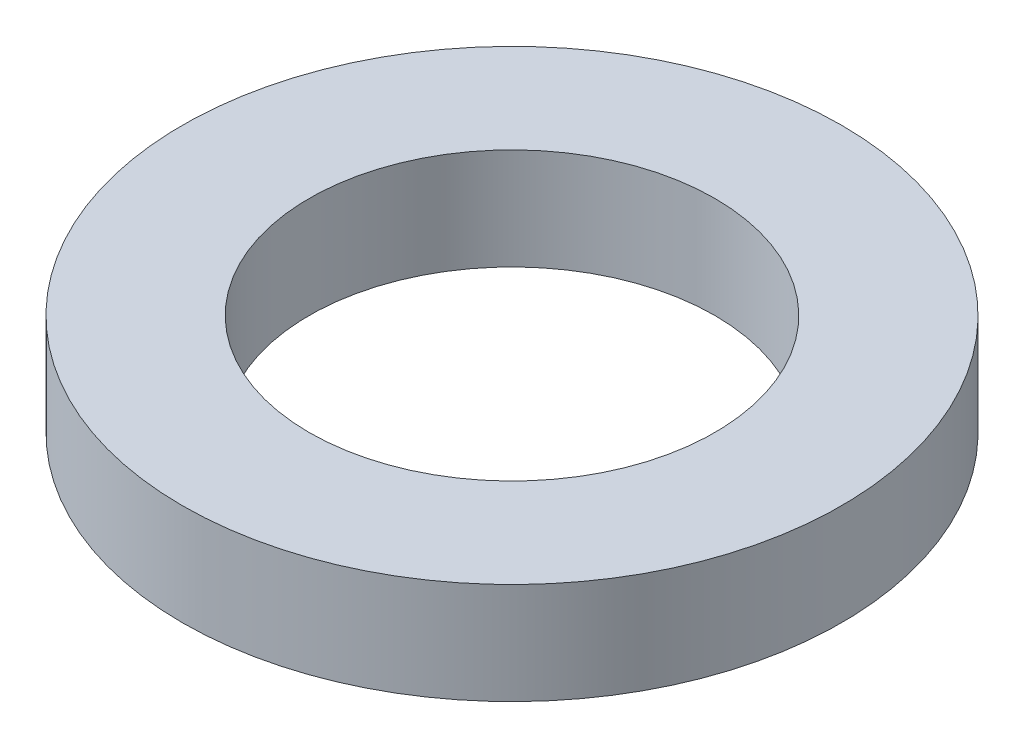
ISO-10303-21;
HEADER;
FILE_DESCRIPTION(('STEP AP214'),'2;1');
FILE_NAME('part.step','',(''),(''),'','','');
FILE_SCHEMA(('AUTOMOTIVE_DESIGN { 1 0 10303 214 1 1 1 1 }'));
ENDSEC;
DATA;
#1=APPLICATION_CONTEXT('core data for automotive mechanical design processes');
#2=APPLICATION_PROTOCOL_DEFINITION('international standard','automotive_design',2000,#1);
#3=PRODUCT_CONTEXT('',#1,'mechanical');
#4=PRODUCT('Part','Part','',(#3));
#5=PRODUCT_RELATED_PRODUCT_CATEGORY('part','',(#4));
#6=PRODUCT_DEFINITION_FORMATION('','',#4);
#7=PRODUCT_DEFINITION_CONTEXT('part definition',#1,'design');
#8=PRODUCT_DEFINITION('design','',#6,#7);
#9=PRODUCT_DEFINITION_SHAPE('','',#8);
#10=(LENGTH_UNIT() NAMED_UNIT(*) SI_UNIT(.MILLI.,.METRE.));
#11=(NAMED_UNIT(*) PLANE_ANGLE_UNIT() SI_UNIT($,.RADIAN.));
#12=(NAMED_UNIT(*) SI_UNIT($,.STERADIAN.) SOLID_ANGLE_UNIT());
#13=UNCERTAINTY_MEASURE_WITH_UNIT(LENGTH_MEASURE(1.E-05),#10,'distance_accuracy_value','');
#14=(GEOMETRIC_REPRESENTATION_CONTEXT(3) GLOBAL_UNCERTAINTY_ASSIGNED_CONTEXT((#13)) GLOBAL_UNIT_ASSIGNED_CONTEXT((#10,
#11,#12)) REPRESENTATION_CONTEXT('',''));
#15=CARTESIAN_POINT('',(0.,0.,0.));
#16=DIRECTION('',(0.,0.,1.));
#17=DIRECTION('',(1.,0.,0.));
#18=AXIS2_PLACEMENT_3D('',#15,#16,#17);
#19=CARTESIAN_POINT('',(0.,20.,0.));
#20=DIRECTION('',(0.,-1.,0.));
#21=DIRECTION('',(0.,0.,-1.));
#22=AXIS2_PLACEMENT_3D('',#19,#20,#21);
#23=CYLINDRICAL_SURFACE('',#22,65.);
#24=CARTESIAN_POINT('',(0.,20.,0.));
#25=DIRECTION('',(0.,1.,0.));
#26=DIRECTION('',(0.,0.,1.));
#27=AXIS2_PLACEMENT_3D('',#24,#25,#26);
#28=CIRCLE('',#27,65.);
#29=CARTESIAN_POINT('',(0.,20.,65.));
#30=VERTEX_POINT('',#29);
#31=EDGE_CURVE('E10',#30,#30,#28,.T.);
#32=ORIENTED_EDGE('',*,*,#31,.F.);
#33=EDGE_LOOP('',(#32));
#34=FACE_BOUND('',#33,.T.);
#35=CARTESIAN_POINT('',(0.,0.,0.));
#36=DIRECTION('',(0.,1.,0.));
#37=DIRECTION('',(0.,0.,1.));
#38=AXIS2_PLACEMENT_3D('',#35,#36,#37);
#39=CIRCLE('',#38,65.);
#40=CARTESIAN_POINT('',(0.,0.,65.));
#41=VERTEX_POINT('',#40);
#42=EDGE_CURVE('E37',#41,#41,#39,.T.);
#43=ORIENTED_EDGE('',*,*,#42,.T.);
#44=EDGE_LOOP('',(#43));
#45=FACE_BOUND('',#44,.T.);
#46=ADVANCED_FACE('F40',(#34,#45),#23,.T.);
#47=CARTESIAN_POINT('',(0.,20.,0.));
#48=DIRECTION('',(0.,1.,0.));
#49=DIRECTION('',(0.,0.,1.));
#50=AXIS2_PLACEMENT_3D('',#47,#48,#49);
#51=PLANE('',#50);
#52=CARTESIAN_POINT('',(0.,20.,0.));
#53=DIRECTION('',(0.,1.,0.));
#54=DIRECTION('',(0.,0.,1.));
#55=AXIS2_PLACEMENT_3D('',#52,#53,#54);
#56=CIRCLE('',#55,40.);
#57=CARTESIAN_POINT('',(0.,20.,40.));
#58=VERTEX_POINT('',#57);
#59=EDGE_CURVE('E50',#58,#58,#56,.T.);
#60=ORIENTED_EDGE('',*,*,#59,.F.);
#61=EDGE_LOOP('',(#60));
#62=FACE_BOUND('',#61,.T.);
#63=ORIENTED_EDGE('',*,*,#31,.T.);
#64=EDGE_LOOP('',(#63));
#65=FACE_BOUND('',#64,.T.);
#66=ADVANCED_FACE('F59',(#62,#65),#51,.T.);
#67=CARTESIAN_POINT('',(0.,0.,0.));
#68=DIRECTION('',(0.,1.,0.));
#69=DIRECTION('',(0.,0.,1.));
#70=AXIS2_PLACEMENT_3D('',#67,#68,#69);
#71=PLANE('',#70);
#72=CARTESIAN_POINT('',(0.,0.,0.));
#73=DIRECTION('',(0.,1.,0.));
#74=DIRECTION('',(0.,0.,1.));
#75=AXIS2_PLACEMENT_3D('',#72,#73,#74);
#76=CIRCLE('',#75,40.);
#77=CARTESIAN_POINT('',(0.,0.,40.));
#78=VERTEX_POINT('',#77);
#79=EDGE_CURVE('E47',#78,#78,#76,.T.);
#80=ORIENTED_EDGE('',*,*,#79,.T.);
#81=EDGE_LOOP('',(#80));
#82=FACE_BOUND('',#81,.T.);
#83=ORIENTED_EDGE('',*,*,#42,.F.);
#84=EDGE_LOOP('',(#83));
#85=FACE_BOUND('',#84,.T.);
#86=ADVANCED_FACE('F58',(#82,#85),#71,.F.);
#87=CARTESIAN_POINT('',(0.,20.,0.));
#88=DIRECTION('',(0.,-1.,0.));
#89=DIRECTION('',(0.,0.,-1.));
#90=AXIS2_PLACEMENT_3D('',#87,#88,#89);
#91=CYLINDRICAL_SURFACE('',#90,40.);
#92=ORIENTED_EDGE('',*,*,#59,.T.);
#93=EDGE_LOOP('',(#92));
#94=FACE_BOUND('',#93,.T.);
#95=ORIENTED_EDGE('',*,*,#79,.F.);
#96=EDGE_LOOP('',(#95));
#97=FACE_BOUND('',#96,.T.);
#98=ADVANCED_FACE('F54',(#94,#97),#91,.F.);
#99=CLOSED_SHELL('',(#46,#66,#86,#98));
#100=MANIFOLD_SOLID_BREP('B2',#99);
#101=ADVANCED_BREP_SHAPE_REPRESENTATION('',(#18,#100),#14);
#102=SHAPE_DEFINITION_REPRESENTATION(#9,#101);
ENDSEC;
END-ISO-10303-21;
